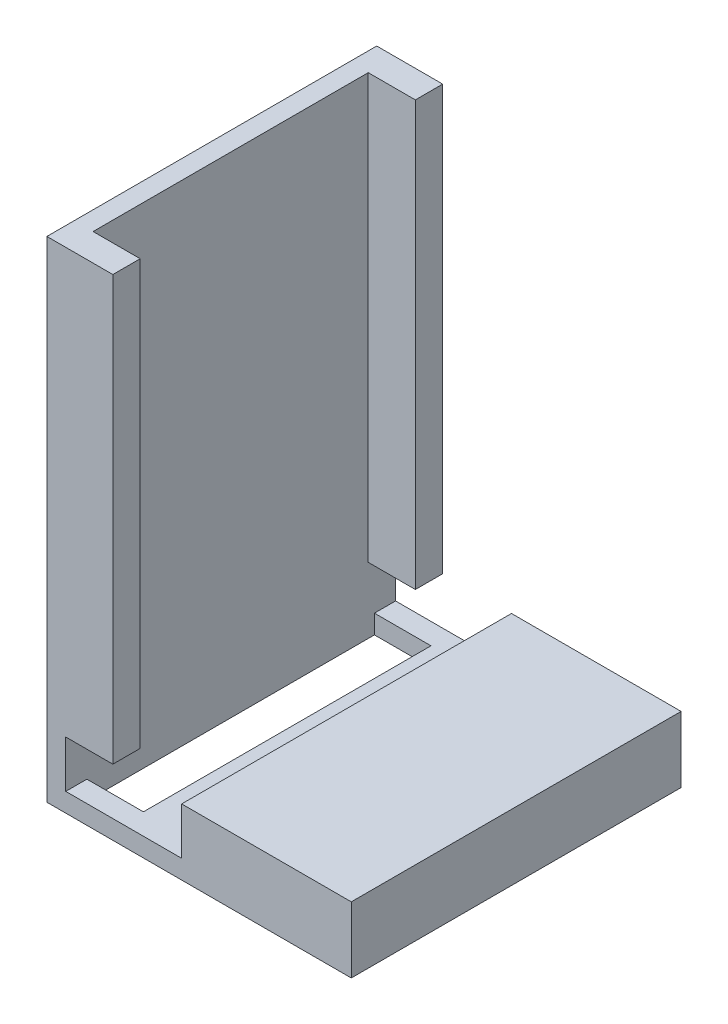
ISO-10303-21;
HEADER;
FILE_DESCRIPTION(('STEP AP214'),'2;1');
FILE_NAME('part.step','',(''),(''),'','','');
FILE_SCHEMA(('AUTOMOTIVE_DESIGN { 1 0 10303 214 1 1 1 1 }'));
ENDSEC;
DATA;
#1=APPLICATION_CONTEXT('core data for automotive mechanical design processes');
#2=APPLICATION_PROTOCOL_DEFINITION('international standard','automotive_design',2000,#1);
#3=PRODUCT_CONTEXT('',#1,'mechanical');
#4=PRODUCT('Part','Part','',(#3));
#5=PRODUCT_RELATED_PRODUCT_CATEGORY('part','',(#4));
#6=PRODUCT_DEFINITION_FORMATION('','',#4);
#7=PRODUCT_DEFINITION_CONTEXT('part definition',#1,'design');
#8=PRODUCT_DEFINITION('design','',#6,#7);
#9=PRODUCT_DEFINITION_SHAPE('','',#8);
#10=(LENGTH_UNIT() NAMED_UNIT(*) SI_UNIT(.MILLI.,.METRE.));
#11=(NAMED_UNIT(*) PLANE_ANGLE_UNIT() SI_UNIT($,.RADIAN.));
#12=(NAMED_UNIT(*) SI_UNIT($,.STERADIAN.) SOLID_ANGLE_UNIT());
#13=UNCERTAINTY_MEASURE_WITH_UNIT(LENGTH_MEASURE(1.E-05),#10,'distance_accuracy_value','');
#14=(GEOMETRIC_REPRESENTATION_CONTEXT(3) GLOBAL_UNCERTAINTY_ASSIGNED_CONTEXT((#13)) GLOBAL_UNIT_ASSIGNED_CONTEXT((#10,
#11,#12)) REPRESENTATION_CONTEXT('',''));
#15=CARTESIAN_POINT('',(0.,0.,0.));
#16=DIRECTION('',(0.,0.,1.));
#17=DIRECTION('',(1.,0.,0.));
#18=AXIS2_PLACEMENT_3D('',#15,#16,#17);
#19=CARTESIAN_POINT('',(1.99999999999978,0.,35.));
#20=DIRECTION('',(-1.,0.,0.));
#21=DIRECTION('',(0.,-1.,0.));
#22=AXIS2_PLACEMENT_3D('',#19,#20,#21);
#23=PLANE('',#22);
#24=DIRECTION('',(0.,-1.,0.));
#25=VECTOR('',#24,1.);
#26=CARTESIAN_POINT('',(2.,5.,2.2427961266223));
#27=LINE('',#26,#25);
#28=CARTESIAN_POINT('',(2.,1.99999999999981,2.2427961266223));
#29=VERTEX_POINT('',#28);
#30=CARTESIAN_POINT('',(2.,0.,2.2427961266223));
#31=VERTEX_POINT('',#30);
#32=EDGE_CURVE('E176',#29,#31,#27,.T.);
#33=ORIENTED_EDGE('',*,*,#32,.F.);
#34=DIRECTION('',(0.,0.,-1.));
#35=VECTOR('',#34,1.);
#36=CARTESIAN_POINT('',(1.99999999999989,1.99999999999979,35.));
#37=LINE('',#36,#35);
#38=CARTESIAN_POINT('',(1.99999999999989,1.99999999999979,0.));
#39=VERTEX_POINT('',#38);
#40=EDGE_CURVE('E351',#29,#39,#37,.T.);
#41=ORIENTED_EDGE('',*,*,#40,.T.);
#42=DIRECTION('',(0.,1.,0.));
#43=VECTOR('',#42,1.);
#44=CARTESIAN_POINT('',(1.99999999999978,0.,0.));
#45=LINE('',#44,#43);
#46=CARTESIAN_POINT('',(1.99999999999981,7.00000000000017,0.));
#47=VERTEX_POINT('',#46);
#48=EDGE_CURVE('E313',#39,#47,#45,.T.);
#49=ORIENTED_EDGE('',*,*,#48,.T.);
#50=DIRECTION('',(0.,0.,-1.));
#51=VECTOR('',#50,1.);
#52=CARTESIAN_POINT('',(1.99999999999982,7.00000000000021,0.));
#53=LINE('',#52,#51);
#54=CARTESIAN_POINT('',(1.99999999999981,7.00000000000021,2.9));
#55=VERTEX_POINT('',#54);
#56=EDGE_CURVE('E215',#55,#47,#53,.T.);
#57=ORIENTED_EDGE('',*,*,#56,.F.);
#58=DIRECTION('',(0.,-1.,0.));
#59=VECTOR('',#58,1.);
#60=CARTESIAN_POINT('',(1.99999999999978,0.,2.9));
#61=LINE('',#60,#59);
#62=CARTESIAN_POINT('',(2.,52.,2.90000000000001));
#63=VERTEX_POINT('',#62);
#64=EDGE_CURVE('E209',#63,#55,#61,.T.);
#65=ORIENTED_EDGE('',*,*,#64,.F.);
#66=DIRECTION('',(0.,0.,-1.));
#67=VECTOR('',#66,1.);
#68=CARTESIAN_POINT('',(2.,52.,35.));
#69=LINE('',#68,#67);
#70=CARTESIAN_POINT('',(2.00000000000007,52.,32.1));
#71=VERTEX_POINT('',#70);
#72=EDGE_CURVE('E348',#71,#63,#69,.T.);
#73=ORIENTED_EDGE('',*,*,#72,.F.);
#74=DIRECTION('',(0.,-1.,0.));
#75=VECTOR('',#74,1.);
#76=CARTESIAN_POINT('',(1.99999999999978,0.,32.1));
#77=LINE('',#76,#75);
#78=CARTESIAN_POINT('',(1.99999999999982,7.00000000000017,32.1));
#79=VERTEX_POINT('',#78);
#80=EDGE_CURVE('E249',#71,#79,#77,.T.);
#81=ORIENTED_EDGE('',*,*,#80,.T.);
#82=DIRECTION('',(0.,0.,-1.));
#83=VECTOR('',#82,1.);
#84=CARTESIAN_POINT('',(1.99999999999982,7.00000000000021,0.));
#85=LINE('',#84,#83);
#86=CARTESIAN_POINT('',(1.99999999999982,7.00000000000021,35.));
#87=VERTEX_POINT('',#86);
#88=EDGE_CURVE('E243',#87,#79,#85,.T.);
#89=ORIENTED_EDGE('',*,*,#88,.F.);
#90=DIRECTION('',(0.,1.,0.));
#91=VECTOR('',#90,1.);
#92=CARTESIAN_POINT('',(1.99999999999978,0.,35.));
#93=LINE('',#92,#91);
#94=CARTESIAN_POINT('',(1.99999999999989,1.99999999999979,35.));
#95=VERTEX_POINT('',#94);
#96=EDGE_CURVE('E285',#95,#87,#93,.T.);
#97=ORIENTED_EDGE('',*,*,#96,.F.);
#98=CARTESIAN_POINT('',(2.,1.99999999999981,32.7572038733777));
#99=VERTEX_POINT('',#98);
#100=EDGE_CURVE('E50',#95,#99,#37,.T.);
#101=ORIENTED_EDGE('',*,*,#100,.T.);
#102=DIRECTION('',(0.,-1.,0.));
#103=VECTOR('',#102,1.);
#104=CARTESIAN_POINT('',(2.,5.,32.7572038733777));
#105=LINE('',#104,#103);
#106=CARTESIAN_POINT('',(2.,0.,32.7572038733777));
#107=VERTEX_POINT('',#106);
#108=EDGE_CURVE('E194',#99,#107,#105,.T.);
#109=ORIENTED_EDGE('',*,*,#108,.T.);
#110=DIRECTION('',(0.,0.,-1.));
#111=VECTOR('',#110,1.);
#112=CARTESIAN_POINT('',(2.,0.,32.7572038733777));
#113=LINE('',#112,#111);
#114=EDGE_CURVE('E65',#107,#31,#113,.T.);
#115=ORIENTED_EDGE('',*,*,#114,.T.);
#116=EDGE_LOOP('',(#33,#41,#49,#57,#65,#73,#81,#89,#97,#101,#109,#115));
#117=FACE_BOUND('',#116,.T.);
#118=ADVANCED_FACE('F41',(#117),#23,.F.);
#119=CARTESIAN_POINT('',(14.3,0.,35.));
#120=DIRECTION('',(-1.,0.,0.));
#121=DIRECTION('',(0.,0.,1.));
#122=AXIS2_PLACEMENT_3D('',#119,#120,#121);
#123=PLANE('',#122);
#124=DIRECTION('',(0.,1.,0.));
#125=VECTOR('',#124,1.);
#126=CARTESIAN_POINT('',(14.3,0.,0.));
#127=LINE('',#126,#125);
#128=CARTESIAN_POINT('',(14.3,1.99999999999988,0.));
#129=VERTEX_POINT('',#128);
#130=CARTESIAN_POINT('',(14.3,7.,0.));
#131=VERTEX_POINT('',#130);
#132=EDGE_CURVE('E275',#129,#131,#127,.T.);
#133=ORIENTED_EDGE('',*,*,#132,.F.);
#134=DIRECTION('',(0.,0.,-1.));
#135=VECTOR('',#134,1.);
#136=CARTESIAN_POINT('',(14.3,1.99999999999988,35.));
#137=LINE('',#136,#135);
#138=CARTESIAN_POINT('',(14.3,1.99999999999988,35.));
#139=VERTEX_POINT('',#138);
#140=EDGE_CURVE('E11',#139,#129,#137,.T.);
#141=ORIENTED_EDGE('',*,*,#140,.F.);
#142=DIRECTION('',(0.,1.,0.));
#143=VECTOR('',#142,1.);
#144=CARTESIAN_POINT('',(14.3,0.,35.));
#145=LINE('',#144,#143);
#146=CARTESIAN_POINT('',(14.3,7.,35.));
#147=VERTEX_POINT('',#146);
#148=EDGE_CURVE('E276',#139,#147,#145,.T.);
#149=ORIENTED_EDGE('',*,*,#148,.T.);
#150=DIRECTION('',(0.,0.,-1.));
#151=VECTOR('',#150,1.);
#152=CARTESIAN_POINT('',(14.3,7.,35.));
#153=LINE('',#152,#151);
#154=EDGE_CURVE('E305',#147,#131,#153,.T.);
#155=ORIENTED_EDGE('',*,*,#154,.T.);
#156=EDGE_LOOP('',(#133,#141,#149,#155));
#157=FACE_BOUND('',#156,.T.);
#158=ADVANCED_FACE('F43',(#157),#123,.T.);
#159=CARTESIAN_POINT('',(0.,1.99999999999978,35.));
#160=DIRECTION('',(0.,1.,0.));
#161=DIRECTION('',(-1.,0.,0.));
#162=AXIS2_PLACEMENT_3D('',#159,#160,#161);
#163=PLANE('',#162);
#164=DIRECTION('',(1.,0.,0.));
#165=VECTOR('',#164,1.);
#166=CARTESIAN_POINT('',(0.,1.99999999999978,32.7572038733777));
#167=LINE('',#166,#165);
#168=CARTESIAN_POINT('',(8.,1.99999999999983,32.7572038733777));
#169=VERTEX_POINT('',#168);
#170=EDGE_CURVE('E206',#99,#169,#167,.T.);
#171=ORIENTED_EDGE('',*,*,#170,.F.);
#172=ORIENTED_EDGE('',*,*,#100,.F.);
#173=DIRECTION('',(1.,0.,0.));
#174=VECTOR('',#173,1.);
#175=CARTESIAN_POINT('',(0.,1.99999999999978,35.));
#176=LINE('',#175,#174);
#177=EDGE_CURVE('E280',#95,#139,#176,.T.);
#178=ORIENTED_EDGE('',*,*,#177,.T.);
#179=ORIENTED_EDGE('',*,*,#140,.T.);
#180=DIRECTION('',(1.,0.,0.));
#181=VECTOR('',#180,1.);
#182=CARTESIAN_POINT('',(0.,1.99999999999978,0.));
#183=LINE('',#182,#181);
#184=EDGE_CURVE('E309',#39,#129,#183,.T.);
#185=ORIENTED_EDGE('',*,*,#184,.F.);
#186=ORIENTED_EDGE('',*,*,#40,.F.);
#187=DIRECTION('',(-1.,0.,0.));
#188=VECTOR('',#187,1.);
#189=CARTESIAN_POINT('',(0.,1.99999999999978,2.2427961266223));
#190=LINE('',#189,#188);
#191=CARTESIAN_POINT('',(8.,1.99999999999983,2.2427961266223));
#192=VERTEX_POINT('',#191);
#193=EDGE_CURVE('E197',#192,#29,#190,.T.);
#194=ORIENTED_EDGE('',*,*,#193,.F.);
#195=DIRECTION('',(0.,0.,-1.));
#196=VECTOR('',#195,1.);
#197=CARTESIAN_POINT('',(8.,1.99999999999983,35.));
#198=LINE('',#197,#196);
#199=EDGE_CURVE('E172',#169,#192,#198,.T.);
#200=ORIENTED_EDGE('',*,*,#199,.F.);
#201=EDGE_LOOP('',(#171,#172,#178,#179,#185,#186,#194,#200));
#202=FACE_BOUND('',#201,.T.);
#203=ADVANCED_FACE('F365',(#202),#163,.T.);
#204=CARTESIAN_POINT('',(0.,52.,35.));
#205=DIRECTION('',(0.,1.,0.));
#206=DIRECTION('',(0.,0.,1.));
#207=AXIS2_PLACEMENT_3D('',#204,#205,#206);
#208=PLANE('',#207);
#209=DIRECTION('',(1.,0.,0.));
#210=VECTOR('',#209,1.);
#211=CARTESIAN_POINT('',(0.,52.,0.));
#212=LINE('',#211,#210);
#213=CARTESIAN_POINT('',(0.,52.,0.));
#214=VERTEX_POINT('',#213);
#215=CARTESIAN_POINT('',(7.00000000000007,52.,0.));
#216=VERTEX_POINT('',#215);
#217=EDGE_CURVE('E316',#214,#216,#212,.T.);
#218=ORIENTED_EDGE('',*,*,#217,.F.);
#219=DIRECTION('',(0.,0.,-1.));
#220=VECTOR('',#219,1.);
#221=CARTESIAN_POINT('',(0.,52.,35.));
#222=LINE('',#221,#220);
#223=CARTESIAN_POINT('',(0.,52.,35.));
#224=VERTEX_POINT('',#223);
#225=EDGE_CURVE('E345',#224,#214,#222,.T.);
#226=ORIENTED_EDGE('',*,*,#225,.F.);
#227=DIRECTION('',(1.,0.,0.));
#228=VECTOR('',#227,1.);
#229=CARTESIAN_POINT('',(0.,52.,35.));
#230=LINE('',#229,#228);
#231=CARTESIAN_POINT('',(7.00000000000007,52.,35.));
#232=VERTEX_POINT('',#231);
#233=EDGE_CURVE('E289',#224,#232,#230,.T.);
#234=ORIENTED_EDGE('',*,*,#233,.T.);
#235=DIRECTION('',(0.,0.,1.));
#236=VECTOR('',#235,1.);
#237=CARTESIAN_POINT('',(7.00000000000007,52.,0.));
#238=LINE('',#237,#236);
#239=CARTESIAN_POINT('',(7.00000000000007,52.,32.1));
#240=VERTEX_POINT('',#239);
#241=EDGE_CURVE('E256',#240,#232,#238,.T.);
#242=ORIENTED_EDGE('',*,*,#241,.F.);
#243=DIRECTION('',(-1.,0.,0.));
#244=VECTOR('',#243,1.);
#245=CARTESIAN_POINT('',(7.00000000000007,52.,32.1));
#246=LINE('',#245,#244);
#247=EDGE_CURVE('E260',#240,#71,#246,.T.);
#248=ORIENTED_EDGE('',*,*,#247,.T.);
#249=ORIENTED_EDGE('',*,*,#72,.T.);
#250=DIRECTION('',(-1.,0.,0.));
#251=VECTOR('',#250,1.);
#252=CARTESIAN_POINT('',(7.00000000000007,52.,2.90000000000001));
#253=LINE('',#252,#251);
#254=CARTESIAN_POINT('',(7.00000000000007,52.,2.90000000000001));
#255=VERTEX_POINT('',#254);
#256=EDGE_CURVE('E225',#255,#63,#253,.T.);
#257=ORIENTED_EDGE('',*,*,#256,.F.);
#258=DIRECTION('',(0.,0.,1.));
#259=VECTOR('',#258,1.);
#260=CARTESIAN_POINT('',(7.00000000000007,52.,0.));
#261=LINE('',#260,#259);
#262=EDGE_CURVE('E222',#216,#255,#261,.T.);
#263=ORIENTED_EDGE('',*,*,#262,.F.);
#264=EDGE_LOOP('',(#218,#226,#234,#242,#248,#249,#257,#263));
#265=FACE_BOUND('',#264,.T.);
#266=ADVANCED_FACE('F391',(#265),#208,.T.);
#267=CARTESIAN_POINT('',(0.,0.,35.));
#268=DIRECTION('',(-1.,0.,0.));
#269=DIRECTION('',(0.,0.,1.));
#270=AXIS2_PLACEMENT_3D('',#267,#268,#269);
#271=PLANE('',#270);
#272=DIRECTION('',(0.,1.,0.));
#273=VECTOR('',#272,1.);
#274=CARTESIAN_POINT('',(0.,0.,0.));
#275=LINE('',#274,#273);
#276=CARTESIAN_POINT('',(0.,0.,0.));
#277=VERTEX_POINT('',#276);
#278=EDGE_CURVE('E319',#277,#214,#275,.T.);
#279=ORIENTED_EDGE('',*,*,#278,.F.);
#280=DIRECTION('',(0.,0.,-1.));
#281=VECTOR('',#280,1.);
#282=CARTESIAN_POINT('',(0.,0.,35.));
#283=LINE('',#282,#281);
#284=CARTESIAN_POINT('',(0.,0.,35.));
#285=VERTEX_POINT('',#284);
#286=EDGE_CURVE('E342',#285,#277,#283,.T.);
#287=ORIENTED_EDGE('',*,*,#286,.F.);
#288=DIRECTION('',(0.,1.,0.));
#289=VECTOR('',#288,1.);
#290=CARTESIAN_POINT('',(0.,0.,35.));
#291=LINE('',#290,#289);
#292=EDGE_CURVE('E292',#285,#224,#291,.T.);
#293=ORIENTED_EDGE('',*,*,#292,.T.);
#294=ORIENTED_EDGE('',*,*,#225,.T.);
#295=EDGE_LOOP('',(#279,#287,#293,#294));
#296=FACE_BOUND('',#295,.T.);
#297=ADVANCED_FACE('F386',(#296),#271,.T.);
#298=CARTESIAN_POINT('',(0.,0.,35.));
#299=DIRECTION('',(0.,1.,0.));
#300=DIRECTION('',(0.,0.,1.));
#301=AXIS2_PLACEMENT_3D('',#298,#299,#300);
#302=PLANE('',#301);
#303=DIRECTION('',(1.,0.,0.));
#304=VECTOR('',#303,1.);
#305=CARTESIAN_POINT('',(2.,0.,2.2427961266223));
#306=LINE('',#305,#304);
#307=CARTESIAN_POINT('',(8.,0.,2.2427961266223));
#308=VERTEX_POINT('',#307);
#309=EDGE_CURVE('E179',#31,#308,#306,.T.);
#310=ORIENTED_EDGE('',*,*,#309,.F.);
#311=ORIENTED_EDGE('',*,*,#114,.F.);
#312=DIRECTION('',(-1.,0.,0.));
#313=VECTOR('',#312,1.);
#314=CARTESIAN_POINT('',(2.,0.,32.7572038733777));
#315=LINE('',#314,#313);
#316=CARTESIAN_POINT('',(8.,0.,32.7572038733777));
#317=VERTEX_POINT('',#316);
#318=EDGE_CURVE('E187',#317,#107,#315,.T.);
#319=ORIENTED_EDGE('',*,*,#318,.F.);
#320=DIRECTION('',(0.,0.,1.));
#321=VECTOR('',#320,1.);
#322=CARTESIAN_POINT('',(8.,0.,32.7572038733777));
#323=LINE('',#322,#321);
#324=EDGE_CURVE('E169',#308,#317,#323,.T.);
#325=ORIENTED_EDGE('',*,*,#324,.F.);
#326=EDGE_LOOP('',(#310,#311,#319,#325));
#327=FACE_BOUND('',#326,.T.);
#328=DIRECTION('',(1.,0.,0.));
#329=VECTOR('',#328,1.);
#330=CARTESIAN_POINT('',(0.,0.,0.));
#331=LINE('',#330,#329);
#332=CARTESIAN_POINT('',(32.3,0.,0.));
#333=VERTEX_POINT('',#332);
#334=EDGE_CURVE('E323',#277,#333,#331,.T.);
#335=ORIENTED_EDGE('',*,*,#334,.T.);
#336=DIRECTION('',(0.,0.,-1.));
#337=VECTOR('',#336,1.);
#338=CARTESIAN_POINT('',(32.3,0.,35.));
#339=LINE('',#338,#337);
#340=CARTESIAN_POINT('',(32.3,0.,35.));
#341=VERTEX_POINT('',#340);
#342=EDGE_CURVE('E338',#341,#333,#339,.T.);
#343=ORIENTED_EDGE('',*,*,#342,.F.);
#344=DIRECTION('',(1.,0.,0.));
#345=VECTOR('',#344,1.);
#346=CARTESIAN_POINT('',(0.,0.,35.));
#347=LINE('',#346,#345);
#348=EDGE_CURVE('E296',#285,#341,#347,.T.);
#349=ORIENTED_EDGE('',*,*,#348,.F.);
#350=ORIENTED_EDGE('',*,*,#286,.T.);
#351=EDGE_LOOP('',(#335,#343,#349,#350));
#352=FACE_BOUND('',#351,.T.);
#353=ADVANCED_FACE('F184',(#327,#352),#302,.F.);
#354=CARTESIAN_POINT('',(32.3,0.,35.));
#355=DIRECTION('',(-1.,0.,0.));
#356=DIRECTION('',(0.,-1.,0.));
#357=AXIS2_PLACEMENT_3D('',#354,#355,#356);
#358=PLANE('',#357);
#359=DIRECTION('',(0.,1.,0.));
#360=VECTOR('',#359,1.);
#361=CARTESIAN_POINT('',(32.3,0.,0.));
#362=LINE('',#361,#360);
#363=CARTESIAN_POINT('',(32.3,7.,0.));
#364=VERTEX_POINT('',#363);
#365=EDGE_CURVE('E326',#333,#364,#362,.T.);
#366=ORIENTED_EDGE('',*,*,#365,.T.);
#367=DIRECTION('',(0.,0.,-1.));
#368=VECTOR('',#367,1.);
#369=CARTESIAN_POINT('',(32.3,7.,35.));
#370=LINE('',#369,#368);
#371=CARTESIAN_POINT('',(32.3,7.,35.));
#372=VERTEX_POINT('',#371);
#373=EDGE_CURVE('E334',#372,#364,#370,.T.);
#374=ORIENTED_EDGE('',*,*,#373,.F.);
#375=DIRECTION('',(0.,1.,0.));
#376=VECTOR('',#375,1.);
#377=CARTESIAN_POINT('',(32.3,0.,35.));
#378=LINE('',#377,#376);
#379=EDGE_CURVE('E299',#341,#372,#378,.T.);
#380=ORIENTED_EDGE('',*,*,#379,.F.);
#381=ORIENTED_EDGE('',*,*,#342,.T.);
#382=EDGE_LOOP('',(#366,#374,#380,#381));
#383=FACE_BOUND('',#382,.T.);
#384=ADVANCED_FACE('F380',(#383),#358,.F.);
#385=CARTESIAN_POINT('',(0.,7.,35.));
#386=DIRECTION('',(0.,-1.,0.));
#387=DIRECTION('',(1.,0.,0.));
#388=AXIS2_PLACEMENT_3D('',#385,#386,#387);
#389=PLANE('',#388);
#390=DIRECTION('',(-1.,0.,0.));
#391=VECTOR('',#390,1.);
#392=CARTESIAN_POINT('',(0.,7.,0.));
#393=LINE('',#392,#391);
#394=EDGE_CURVE('E281',#364,#131,#393,.T.);
#395=ORIENTED_EDGE('',*,*,#394,.T.);
#396=ORIENTED_EDGE('',*,*,#154,.F.);
#397=DIRECTION('',(-1.,0.,0.));
#398=VECTOR('',#397,1.);
#399=CARTESIAN_POINT('',(0.,7.,35.));
#400=LINE('',#399,#398);
#401=EDGE_CURVE('E302',#372,#147,#400,.T.);
#402=ORIENTED_EDGE('',*,*,#401,.F.);
#403=ORIENTED_EDGE('',*,*,#373,.T.);
#404=EDGE_LOOP('',(#395,#396,#402,#403));
#405=FACE_BOUND('',#404,.T.);
#406=ADVANCED_FACE('F375',(#405),#389,.F.);
#407=CARTESIAN_POINT('',(0.,0.,35.));
#408=DIRECTION('',(0.,0.,1.));
#409=DIRECTION('',(1.,0.,0.));
#410=AXIS2_PLACEMENT_3D('',#407,#408,#409);
#411=PLANE('',#410);
#412=ORIENTED_EDGE('',*,*,#148,.F.);
#413=ORIENTED_EDGE('',*,*,#177,.F.);
#414=ORIENTED_EDGE('',*,*,#96,.T.);
#415=DIRECTION('',(-1.,0.,0.));
#416=VECTOR('',#415,1.);
#417=CARTESIAN_POINT('',(6.99999999999982,7.00000000000018,35.));
#418=LINE('',#417,#416);
#419=CARTESIAN_POINT('',(6.99999999999982,7.00000000000018,35.));
#420=VERTEX_POINT('',#419);
#421=EDGE_CURVE('E272',#420,#87,#418,.T.);
#422=ORIENTED_EDGE('',*,*,#421,.F.);
#423=DIRECTION('',(0.,-1.,0.));
#424=VECTOR('',#423,1.);
#425=CARTESIAN_POINT('',(6.99999999999978,0.,35.));
#426=LINE('',#425,#424);
#427=EDGE_CURVE('E244',#232,#420,#426,.T.);
#428=ORIENTED_EDGE('',*,*,#427,.F.);
#429=ORIENTED_EDGE('',*,*,#233,.F.);
#430=ORIENTED_EDGE('',*,*,#292,.F.);
#431=ORIENTED_EDGE('',*,*,#348,.T.);
#432=ORIENTED_EDGE('',*,*,#379,.T.);
#433=ORIENTED_EDGE('',*,*,#401,.T.);
#434=EDGE_LOOP('',(#412,#413,#414,#422,#428,#429,#430,#431,#432,#433));
#435=FACE_BOUND('',#434,.T.);
#436=ADVANCED_FACE('F438',(#435),#411,.T.);
#437=CARTESIAN_POINT('',(0.,0.,0.));
#438=DIRECTION('',(0.,0.,1.));
#439=DIRECTION('',(1.,0.,0.));
#440=AXIS2_PLACEMENT_3D('',#437,#438,#439);
#441=PLANE('',#440);
#442=ORIENTED_EDGE('',*,*,#132,.T.);
#443=ORIENTED_EDGE('',*,*,#394,.F.);
#444=ORIENTED_EDGE('',*,*,#365,.F.);
#445=ORIENTED_EDGE('',*,*,#334,.F.);
#446=ORIENTED_EDGE('',*,*,#278,.T.);
#447=ORIENTED_EDGE('',*,*,#217,.T.);
#448=DIRECTION('',(0.,1.,0.));
#449=VECTOR('',#448,1.);
#450=CARTESIAN_POINT('',(6.99999999999978,0.,0.));
#451=LINE('',#450,#449);
#452=CARTESIAN_POINT('',(6.99999999999982,7.00000000000018,0.));
#453=VERTEX_POINT('',#452);
#454=EDGE_CURVE('E218',#453,#216,#451,.T.);
#455=ORIENTED_EDGE('',*,*,#454,.F.);
#456=DIRECTION('',(-1.,0.,0.));
#457=VECTOR('',#456,1.);
#458=CARTESIAN_POINT('',(6.99999999999982,7.00000000000018,0.));
#459=LINE('',#458,#457);
#460=EDGE_CURVE('E235',#453,#47,#459,.T.);
#461=ORIENTED_EDGE('',*,*,#460,.T.);
#462=ORIENTED_EDGE('',*,*,#48,.F.);
#463=ORIENTED_EDGE('',*,*,#184,.T.);
#464=EDGE_LOOP('',(#442,#443,#444,#445,#446,#447,#455,#461,#462,#463));
#465=FACE_BOUND('',#464,.T.);
#466=ADVANCED_FACE('F361',(#465),#441,.F.);
#467=CARTESIAN_POINT('',(6.99999999999982,7.00000000000018,0.));
#468=DIRECTION('',(0.,1.,0.));
#469=DIRECTION('',(-1.,0.,0.));
#470=AXIS2_PLACEMENT_3D('',#467,#468,#469);
#471=PLANE('',#470);
#472=ORIENTED_EDGE('',*,*,#88,.T.);
#473=DIRECTION('',(-1.,0.,0.));
#474=VECTOR('',#473,1.);
#475=CARTESIAN_POINT('',(6.99999999999982,7.00000000000014,32.1));
#476=LINE('',#475,#474);
#477=CARTESIAN_POINT('',(6.99999999999982,7.00000000000014,32.1));
#478=VERTEX_POINT('',#477);
#479=EDGE_CURVE('E269',#478,#79,#476,.T.);
#480=ORIENTED_EDGE('',*,*,#479,.F.);
#481=DIRECTION('',(0.,0.,-1.));
#482=VECTOR('',#481,1.);
#483=CARTESIAN_POINT('',(6.99999999999982,7.00000000000018,0.));
#484=LINE('',#483,#482);
#485=EDGE_CURVE('E248',#420,#478,#484,.T.);
#486=ORIENTED_EDGE('',*,*,#485,.F.);
#487=ORIENTED_EDGE('',*,*,#421,.T.);
#488=EDGE_LOOP('',(#472,#480,#486,#487));
#489=FACE_BOUND('',#488,.T.);
#490=ADVANCED_FACE('F441',(#489),#471,.F.);
#491=CARTESIAN_POINT('',(6.99999999999978,0.,32.1));
#492=DIRECTION('',(0.,0.,-1.));
#493=DIRECTION('',(-1.,0.,0.));
#494=AXIS2_PLACEMENT_3D('',#491,#492,#493);
#495=PLANE('',#494);
#496=ORIENTED_EDGE('',*,*,#80,.F.);
#497=ORIENTED_EDGE('',*,*,#247,.F.);
#498=DIRECTION('',(0.,-1.,0.));
#499=VECTOR('',#498,1.);
#500=CARTESIAN_POINT('',(6.99999999999978,0.,32.1));
#501=LINE('',#500,#499);
#502=EDGE_CURVE('E252',#240,#478,#501,.T.);
#503=ORIENTED_EDGE('',*,*,#502,.T.);
#504=ORIENTED_EDGE('',*,*,#479,.T.);
#505=EDGE_LOOP('',(#496,#497,#503,#504));
#506=FACE_BOUND('',#505,.T.);
#507=ADVANCED_FACE('F412',(#506),#495,.T.);
#508=CARTESIAN_POINT('',(6.99999999999978,0.,0.));
#509=DIRECTION('',(1.,0.,0.));
#510=DIRECTION('',(0.,1.,0.));
#511=AXIS2_PLACEMENT_3D('',#508,#509,#510);
#512=PLANE('',#511);
#513=ORIENTED_EDGE('',*,*,#427,.T.);
#514=ORIENTED_EDGE('',*,*,#485,.T.);
#515=ORIENTED_EDGE('',*,*,#502,.F.);
#516=ORIENTED_EDGE('',*,*,#241,.T.);
#517=EDGE_LOOP('',(#513,#514,#515,#516));
#518=FACE_BOUND('',#517,.T.);
#519=ADVANCED_FACE('F405',(#518),#512,.T.);
#520=CARTESIAN_POINT('',(6.99999999999978,0.,2.9));
#521=DIRECTION('',(0.,0.,-1.));
#522=DIRECTION('',(0.,1.,0.));
#523=AXIS2_PLACEMENT_3D('',#520,#521,#522);
#524=PLANE('',#523);
#525=ORIENTED_EDGE('',*,*,#64,.T.);
#526=DIRECTION('',(-1.,0.,0.));
#527=VECTOR('',#526,1.);
#528=CARTESIAN_POINT('',(6.99999999999982,7.00000000000014,2.9));
#529=LINE('',#528,#527);
#530=CARTESIAN_POINT('',(6.99999999999982,7.00000000000014,2.9));
#531=VERTEX_POINT('',#530);
#532=EDGE_CURVE('E239',#531,#55,#529,.T.);
#533=ORIENTED_EDGE('',*,*,#532,.F.);
#534=DIRECTION('',(0.,-1.,0.));
#535=VECTOR('',#534,1.);
#536=CARTESIAN_POINT('',(6.99999999999978,0.,2.9));
#537=LINE('',#536,#535);
#538=EDGE_CURVE('E210',#255,#531,#537,.T.);
#539=ORIENTED_EDGE('',*,*,#538,.F.);
#540=ORIENTED_EDGE('',*,*,#256,.T.);
#541=EDGE_LOOP('',(#525,#533,#539,#540));
#542=FACE_BOUND('',#541,.T.);
#543=ADVANCED_FACE('F403',(#542),#524,.F.);
#544=CARTESIAN_POINT('',(6.99999999999982,7.00000000000018,0.));
#545=DIRECTION('',(0.,1.,0.));
#546=DIRECTION('',(-1.,0.,0.));
#547=AXIS2_PLACEMENT_3D('',#544,#545,#546);
#548=PLANE('',#547);
#549=ORIENTED_EDGE('',*,*,#56,.T.);
#550=ORIENTED_EDGE('',*,*,#460,.F.);
#551=DIRECTION('',(0.,0.,-1.));
#552=VECTOR('',#551,1.);
#553=CARTESIAN_POINT('',(6.99999999999982,7.00000000000018,0.));
#554=LINE('',#553,#552);
#555=EDGE_CURVE('E214',#531,#453,#554,.T.);
#556=ORIENTED_EDGE('',*,*,#555,.F.);
#557=ORIENTED_EDGE('',*,*,#532,.T.);
#558=EDGE_LOOP('',(#549,#550,#556,#557));
#559=FACE_BOUND('',#558,.T.);
#560=ADVANCED_FACE('F398',(#559),#548,.F.);
#561=CARTESIAN_POINT('',(6.99999999999978,0.,0.));
#562=DIRECTION('',(1.,0.,0.));
#563=DIRECTION('',(0.,1.,0.));
#564=AXIS2_PLACEMENT_3D('',#561,#562,#563);
#565=PLANE('',#564);
#566=ORIENTED_EDGE('',*,*,#538,.T.);
#567=ORIENTED_EDGE('',*,*,#555,.T.);
#568=ORIENTED_EDGE('',*,*,#454,.T.);
#569=ORIENTED_EDGE('',*,*,#262,.T.);
#570=EDGE_LOOP('',(#566,#567,#568,#569));
#571=FACE_BOUND('',#570,.T.);
#572=ADVANCED_FACE('F394',(#571),#565,.T.);
#573=CARTESIAN_POINT('',(2.,5.,32.7572038733777));
#574=DIRECTION('',(0.,0.,1.));
#575=DIRECTION('',(1.,0.,0.));
#576=AXIS2_PLACEMENT_3D('',#573,#574,#575);
#577=PLANE('',#576);
#578=ORIENTED_EDGE('',*,*,#170,.T.);
#579=DIRECTION('',(0.,-1.,0.));
#580=VECTOR('',#579,1.);
#581=CARTESIAN_POINT('',(8.,5.,32.7572038733777));
#582=LINE('',#581,#580);
#583=EDGE_CURVE('E175',#169,#317,#582,.T.);
#584=ORIENTED_EDGE('',*,*,#583,.T.);
#585=ORIENTED_EDGE('',*,*,#318,.T.);
#586=ORIENTED_EDGE('',*,*,#108,.F.);
#587=EDGE_LOOP('',(#578,#584,#585,#586));
#588=FACE_BOUND('',#587,.T.);
#589=ADVANCED_FACE('F481',(#588),#577,.F.);
#590=CARTESIAN_POINT('',(8.,5.,32.7572038733777));
#591=DIRECTION('',(1.,0.,0.));
#592=DIRECTION('',(0.,0.,-1.));
#593=AXIS2_PLACEMENT_3D('',#590,#591,#592);
#594=PLANE('',#593);
#595=ORIENTED_EDGE('',*,*,#199,.T.);
#596=DIRECTION('',(0.,-1.,0.));
#597=VECTOR('',#596,1.);
#598=CARTESIAN_POINT('',(8.,5.,2.2427961266223));
#599=LINE('',#598,#597);
#600=EDGE_CURVE('E57',#192,#308,#599,.T.);
#601=ORIENTED_EDGE('',*,*,#600,.T.);
#602=ORIENTED_EDGE('',*,*,#324,.T.);
#603=ORIENTED_EDGE('',*,*,#583,.F.);
#604=EDGE_LOOP('',(#595,#601,#602,#603));
#605=FACE_BOUND('',#604,.T.);
#606=ADVANCED_FACE('F166',(#605),#594,.F.);
#607=CARTESIAN_POINT('',(2.,5.,2.2427961266223));
#608=DIRECTION('',(0.,0.,-1.));
#609=DIRECTION('',(-1.,0.,0.));
#610=AXIS2_PLACEMENT_3D('',#607,#608,#609);
#611=PLANE('',#610);
#612=ORIENTED_EDGE('',*,*,#193,.T.);
#613=ORIENTED_EDGE('',*,*,#32,.T.);
#614=ORIENTED_EDGE('',*,*,#309,.T.);
#615=ORIENTED_EDGE('',*,*,#600,.F.);
#616=EDGE_LOOP('',(#612,#613,#614,#615));
#617=FACE_BOUND('',#616,.T.);
#618=ADVANCED_FACE('F180',(#617),#611,.F.);
#619=CLOSED_SHELL('',(#118,#158,#203,#266,#297,#353,#384,#406,#436,#466,#490,#507,#519,#543,
#560,#572,#589,#606,#618));
#620=MANIFOLD_SOLID_BREP('B2',#619);
#621=ADVANCED_BREP_SHAPE_REPRESENTATION('',(#18,#620),#14);
#622=SHAPE_DEFINITION_REPRESENTATION(#9,#621);
ENDSEC;
END-ISO-10303-21;
